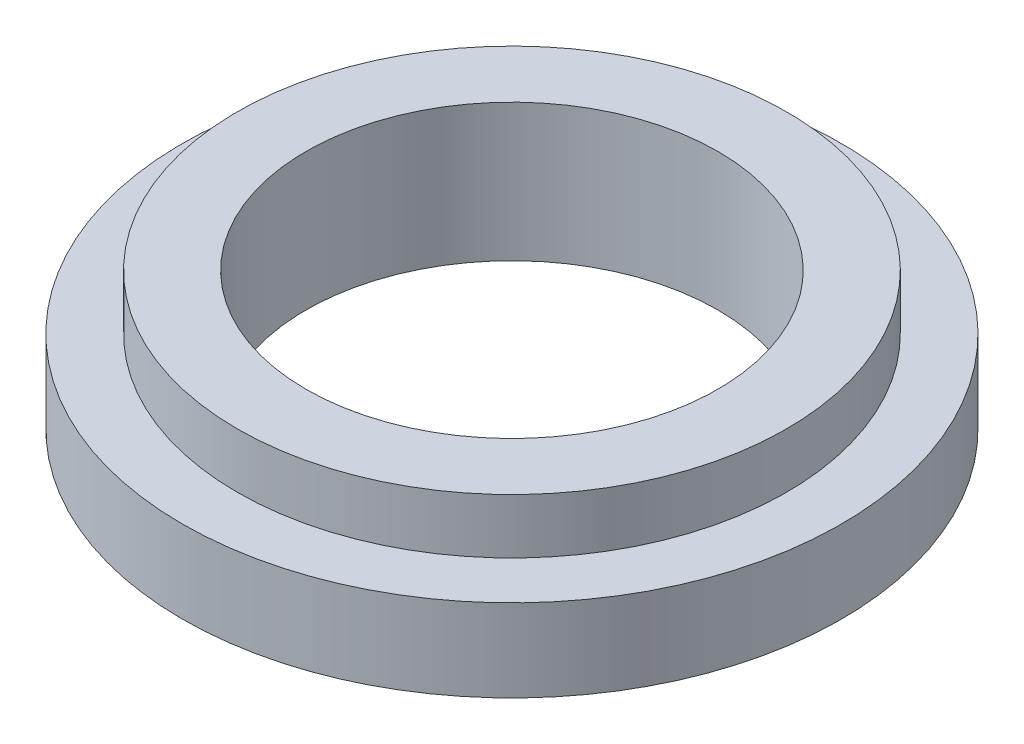
ISO-10303-21;
HEADER;
FILE_DESCRIPTION(('STEP AP214'),'2;1');
FILE_NAME('part.step','',(''),(''),'','','');
FILE_SCHEMA(('AUTOMOTIVE_DESIGN { 1 0 10303 214 1 1 1 1 }'));
ENDSEC;
DATA;
#1=APPLICATION_CONTEXT('core data for automotive mechanical design processes');
#2=APPLICATION_PROTOCOL_DEFINITION('international standard','automotive_design',2000,#1);
#3=PRODUCT_CONTEXT('',#1,'mechanical');
#4=PRODUCT('Part','Part','',(#3));
#5=PRODUCT_RELATED_PRODUCT_CATEGORY('part','',(#4));
#6=PRODUCT_DEFINITION_FORMATION('','',#4);
#7=PRODUCT_DEFINITION_CONTEXT('part definition',#1,'design');
#8=PRODUCT_DEFINITION('design','',#6,#7);
#9=PRODUCT_DEFINITION_SHAPE('','',#8);
#10=(LENGTH_UNIT() NAMED_UNIT(*) SI_UNIT(.MILLI.,.METRE.));
#11=(NAMED_UNIT(*) PLANE_ANGLE_UNIT() SI_UNIT($,.RADIAN.));
#12=(NAMED_UNIT(*) SI_UNIT($,.STERADIAN.) SOLID_ANGLE_UNIT());
#13=UNCERTAINTY_MEASURE_WITH_UNIT(LENGTH_MEASURE(1.E-05),#10,'distance_accuracy_value','');
#14=(GEOMETRIC_REPRESENTATION_CONTEXT(3) GLOBAL_UNCERTAINTY_ASSIGNED_CONTEXT((#13)) GLOBAL_UNIT_ASSIGNED_CONTEXT((#10,
#11,#12)) REPRESENTATION_CONTEXT('',''));
#15=CARTESIAN_POINT('',(0.,0.,0.));
#16=DIRECTION('',(0.,0.,1.));
#17=DIRECTION('',(1.,0.,0.));
#18=AXIS2_PLACEMENT_3D('',#15,#16,#17);
#19=CARTESIAN_POINT('',(0.,3.,0.));
#20=DIRECTION('',(0.,1.,0.));
#21=DIRECTION('',(0.,0.,1.));
#22=AXIS2_PLACEMENT_3D('',#19,#20,#21);
#23=PLANE('',#22);
#24=CARTESIAN_POINT('',(0.,3.,0.));
#25=DIRECTION('',(0.,1.,0.));
#26=DIRECTION('',(0.,0.,1.));
#27=AXIS2_PLACEMENT_3D('',#24,#25,#26);
#28=CIRCLE('',#27,12.);
#29=CARTESIAN_POINT('',(0.,3.,12.));
#30=VERTEX_POINT('',#29);
#31=EDGE_CURVE('E10',#30,#30,#28,.T.);
#32=ORIENTED_EDGE('',*,*,#31,.T.);
#33=EDGE_LOOP('',(#32));
#34=FACE_BOUND('',#33,.T.);
#35=CARTESIAN_POINT('',(0.,3.,0.));
#36=DIRECTION('',(0.,1.,0.));
#37=DIRECTION('',(0.,0.,1.));
#38=AXIS2_PLACEMENT_3D('',#35,#36,#37);
#39=CIRCLE('',#38,10.);
#40=CARTESIAN_POINT('',(0.,3.,10.));
#41=VERTEX_POINT('',#40);
#42=EDGE_CURVE('E83',#41,#41,#39,.T.);
#43=ORIENTED_EDGE('',*,*,#42,.F.);
#44=EDGE_LOOP('',(#43));
#45=FACE_BOUND('',#44,.T.);
#46=ADVANCED_FACE('F31',(#34,#45),#23,.T.);
#47=CARTESIAN_POINT('',(0.,0.,0.));
#48=DIRECTION('',(0.,1.,0.));
#49=DIRECTION('',(0.,0.,1.));
#50=AXIS2_PLACEMENT_3D('',#47,#48,#49);
#51=PLANE('',#50);
#52=CARTESIAN_POINT('',(0.,0.,10.));
#53=DIRECTION('',(0.,-1.,0.));
#54=DIRECTION('',(0.,0.,-1.));
#55=AXIS2_PLACEMENT_3D('',#52,#53,#54);
#56=CIRCLE('',#55,1.);
#57=CARTESIAN_POINT('',(0.,0.,9.));
#58=VERTEX_POINT('',#57);
#59=EDGE_CURVE('E72',#58,#58,#56,.T.);
#60=ORIENTED_EDGE('',*,*,#59,.F.);
#61=EDGE_LOOP('',(#60));
#62=FACE_BOUND('',#61,.T.);
#63=CARTESIAN_POINT('',(8.66025403784438,0.,5.00000000000001));
#64=DIRECTION('',(0.,-1.,0.));
#65=DIRECTION('',(0.,0.,-1.));
#66=AXIS2_PLACEMENT_3D('',#63,#64,#65);
#67=CIRCLE('',#66,1.);
#68=CARTESIAN_POINT('',(8.66025403784438,0.,4.));
#69=VERTEX_POINT('',#68);
#70=EDGE_CURVE('E73',#69,#69,#67,.T.);
#71=ORIENTED_EDGE('',*,*,#70,.F.);
#72=EDGE_LOOP('',(#71));
#73=FACE_BOUND('',#72,.T.);
#74=CARTESIAN_POINT('',(8.66025403784439,0.,-5.));
#75=DIRECTION('',(0.,-1.,0.));
#76=DIRECTION('',(0.,0.,-1.));
#77=AXIS2_PLACEMENT_3D('',#74,#75,#76);
#78=CIRCLE('',#77,1.);
#79=CARTESIAN_POINT('',(8.66025403784439,0.,-6.));
#80=VERTEX_POINT('',#79);
#81=EDGE_CURVE('E47',#80,#80,#78,.T.);
#82=ORIENTED_EDGE('',*,*,#81,.F.);
#83=EDGE_LOOP('',(#82));
#84=FACE_BOUND('',#83,.T.);
#85=CARTESIAN_POINT('',(0.,0.,-10.));
#86=DIRECTION('',(0.,-1.,0.));
#87=DIRECTION('',(0.,0.,-1.));
#88=AXIS2_PLACEMENT_3D('',#85,#86,#87);
#89=CIRCLE('',#88,1.);
#90=CARTESIAN_POINT('',(0.,0.,-11.));
#91=VERTEX_POINT('',#90);
#92=EDGE_CURVE('E54',#91,#91,#89,.T.);
#93=ORIENTED_EDGE('',*,*,#92,.F.);
#94=EDGE_LOOP('',(#93));
#95=FACE_BOUND('',#94,.T.);
#96=CARTESIAN_POINT('',(-8.66025403784439,0.,-5.));
#97=DIRECTION('',(0.,-1.,0.));
#98=DIRECTION('',(0.,0.,-1.));
#99=AXIS2_PLACEMENT_3D('',#96,#97,#98);
#100=CIRCLE('',#99,1.);
#101=CARTESIAN_POINT('',(-8.66025403784439,0.,-6.));
#102=VERTEX_POINT('',#101);
#103=EDGE_CURVE('E60',#102,#102,#100,.T.);
#104=ORIENTED_EDGE('',*,*,#103,.F.);
#105=EDGE_LOOP('',(#104));
#106=FACE_BOUND('',#105,.T.);
#107=CARTESIAN_POINT('',(-8.66025403784439,0.,5.00000000000001));
#108=DIRECTION('',(0.,-1.,0.));
#109=DIRECTION('',(0.,0.,-1.));
#110=AXIS2_PLACEMENT_3D('',#107,#108,#109);
#111=CIRCLE('',#110,1.);
#112=CARTESIAN_POINT('',(-8.66025403784439,0.,4.00000000000001));
#113=VERTEX_POINT('',#112);
#114=EDGE_CURVE('E66',#113,#113,#111,.T.);
#115=ORIENTED_EDGE('',*,*,#114,.F.);
#116=EDGE_LOOP('',(#115));
#117=FACE_BOUND('',#116,.T.);
#118=CARTESIAN_POINT('',(0.,0.,0.));
#119=DIRECTION('',(0.,1.,0.));
#120=DIRECTION('',(0.,0.,1.));
#121=AXIS2_PLACEMENT_3D('',#118,#119,#120);
#122=CIRCLE('',#121,12.);
#123=CARTESIAN_POINT('',(0.,0.,12.));
#124=VERTEX_POINT('',#123);
#125=EDGE_CURVE('E35',#124,#124,#122,.T.);
#126=ORIENTED_EDGE('',*,*,#125,.F.);
#127=EDGE_LOOP('',(#126));
#128=FACE_BOUND('',#127,.T.);
#129=CARTESIAN_POINT('',(0.,0.,0.));
#130=DIRECTION('',(0.,1.,0.));
#131=DIRECTION('',(0.,0.,1.));
#132=AXIS2_PLACEMENT_3D('',#129,#130,#131);
#133=CIRCLE('',#132,7.5);
#134=CARTESIAN_POINT('',(0.,0.,7.5));
#135=VERTEX_POINT('',#134);
#136=EDGE_CURVE('E42',#135,#135,#133,.T.);
#137=ORIENTED_EDGE('',*,*,#136,.T.);
#138=EDGE_LOOP('',(#137));
#139=FACE_BOUND('',#138,.T.);
#140=ADVANCED_FACE('F110',(#62,#73,#84,#95,#106,#117,#128,#139),#51,.F.);
#141=CARTESIAN_POINT('',(0.,3.,0.));
#142=DIRECTION('',(0.,-1.,0.));
#143=DIRECTION('',(0.,0.,-1.));
#144=AXIS2_PLACEMENT_3D('',#141,#142,#143);
#145=CYLINDRICAL_SURFACE('',#144,12.);
#146=ORIENTED_EDGE('',*,*,#31,.F.);
#147=EDGE_LOOP('',(#146));
#148=FACE_BOUND('',#147,.T.);
#149=ORIENTED_EDGE('',*,*,#125,.T.);
#150=EDGE_LOOP('',(#149));
#151=FACE_BOUND('',#150,.T.);
#152=ADVANCED_FACE('F33',(#148,#151),#145,.T.);
#153=CARTESIAN_POINT('',(0.,3.,0.));
#154=DIRECTION('',(0.,-1.,0.));
#155=DIRECTION('',(0.,0.,-1.));
#156=AXIS2_PLACEMENT_3D('',#153,#154,#155);
#157=CYLINDRICAL_SURFACE('',#156,7.5);
#158=ORIENTED_EDGE('',*,*,#136,.F.);
#159=EDGE_LOOP('',(#158));
#160=FACE_BOUND('',#159,.T.);
#161=CARTESIAN_POINT('',(0.,5.,0.));
#162=DIRECTION('',(0.,1.,0.));
#163=DIRECTION('',(0.,0.,1.));
#164=AXIS2_PLACEMENT_3D('',#161,#162,#163);
#165=CIRCLE('',#164,7.5);
#166=CARTESIAN_POINT('',(0.,5.,7.5));
#167=VERTEX_POINT('',#166);
#168=EDGE_CURVE('E86',#167,#167,#165,.T.);
#169=ORIENTED_EDGE('',*,*,#168,.T.);
#170=EDGE_LOOP('',(#169));
#171=FACE_BOUND('',#170,.T.);
#172=ADVANCED_FACE('F92',(#160,#171),#157,.F.);
#173=CARTESIAN_POINT('',(-8.66025403784439,2.2,5.00000000000001));
#174=DIRECTION('',(0.,-1.,0.));
#175=DIRECTION('',(0.,0.,-1.));
#176=AXIS2_PLACEMENT_3D('',#173,#174,#175);
#177=CYLINDRICAL_SURFACE('',#176,1.);
#178=CARTESIAN_POINT('',(-8.66025403784439,2.2,5.00000000000001));
#179=DIRECTION('',(0.,-1.,0.));
#180=DIRECTION('',(0.,0.,-1.));
#181=AXIS2_PLACEMENT_3D('',#178,#179,#180);
#182=CIRCLE('',#181,1.);
#183=CARTESIAN_POINT('',(-8.66025403784439,2.2,4.00000000000001));
#184=VERTEX_POINT('',#183);
#185=EDGE_CURVE('E69',#184,#184,#182,.T.);
#186=ORIENTED_EDGE('',*,*,#185,.F.);
#187=EDGE_LOOP('',(#186));
#188=FACE_BOUND('',#187,.T.);
#189=ORIENTED_EDGE('',*,*,#114,.T.);
#190=EDGE_LOOP('',(#189));
#191=FACE_BOUND('',#190,.T.);
#192=ADVANCED_FACE('F120',(#188,#191),#177,.F.);
#193=CARTESIAN_POINT('',(-8.66025403784439,2.2,5.00000000000001));
#194=DIRECTION('',(0.,-1.,0.));
#195=DIRECTION('',(0.,0.,-1.));
#196=AXIS2_PLACEMENT_3D('',#193,#194,#195);
#197=PLANE('',#196);
#198=ORIENTED_EDGE('',*,*,#185,.T.);
#199=EDGE_LOOP('',(#198));
#200=FACE_BOUND('',#199,.T.);
#201=ADVANCED_FACE('F143',(#200),#197,.T.);
#202=CARTESIAN_POINT('',(-8.66025403784439,2.2,-5.));
#203=DIRECTION('',(0.,-1.,0.));
#204=DIRECTION('',(0.,0.,-1.));
#205=AXIS2_PLACEMENT_3D('',#202,#203,#204);
#206=CYLINDRICAL_SURFACE('',#205,1.);
#207=CARTESIAN_POINT('',(-8.66025403784439,2.2,-5.));
#208=DIRECTION('',(0.,-1.,0.));
#209=DIRECTION('',(0.,0.,-1.));
#210=AXIS2_PLACEMENT_3D('',#207,#208,#209);
#211=CIRCLE('',#210,1.);
#212=CARTESIAN_POINT('',(-8.66025403784439,2.2,-6.));
#213=VERTEX_POINT('',#212);
#214=EDGE_CURVE('E63',#213,#213,#211,.T.);
#215=ORIENTED_EDGE('',*,*,#214,.F.);
#216=EDGE_LOOP('',(#215));
#217=FACE_BOUND('',#216,.T.);
#218=ORIENTED_EDGE('',*,*,#103,.T.);
#219=EDGE_LOOP('',(#218));
#220=FACE_BOUND('',#219,.T.);
#221=ADVANCED_FACE('F140',(#217,#220),#206,.F.);
#222=CARTESIAN_POINT('',(-8.66025403784439,2.2,-5.));
#223=DIRECTION('',(0.,-1.,0.));
#224=DIRECTION('',(0.,0.,-1.));
#225=AXIS2_PLACEMENT_3D('',#222,#223,#224);
#226=PLANE('',#225);
#227=ORIENTED_EDGE('',*,*,#214,.T.);
#228=EDGE_LOOP('',(#227));
#229=FACE_BOUND('',#228,.T.);
#230=ADVANCED_FACE('F135',(#229),#226,.T.);
#231=CARTESIAN_POINT('',(0.,2.2,-10.));
#232=DIRECTION('',(0.,-1.,0.));
#233=DIRECTION('',(0.,0.,-1.));
#234=AXIS2_PLACEMENT_3D('',#231,#232,#233);
#235=CYLINDRICAL_SURFACE('',#234,1.);
#236=CARTESIAN_POINT('',(0.,2.2,-10.));
#237=DIRECTION('',(0.,-1.,0.));
#238=DIRECTION('',(0.,0.,-1.));
#239=AXIS2_PLACEMENT_3D('',#236,#237,#238);
#240=CIRCLE('',#239,1.);
#241=CARTESIAN_POINT('',(0.,2.2,-11.));
#242=VERTEX_POINT('',#241);
#243=EDGE_CURVE('E57',#242,#242,#240,.T.);
#244=ORIENTED_EDGE('',*,*,#243,.F.);
#245=EDGE_LOOP('',(#244));
#246=FACE_BOUND('',#245,.T.);
#247=ORIENTED_EDGE('',*,*,#92,.T.);
#248=EDGE_LOOP('',(#247));
#249=FACE_BOUND('',#248,.T.);
#250=ADVANCED_FACE('F132',(#246,#249),#235,.F.);
#251=CARTESIAN_POINT('',(0.,2.2,-10.));
#252=DIRECTION('',(0.,-1.,0.));
#253=DIRECTION('',(0.,0.,-1.));
#254=AXIS2_PLACEMENT_3D('',#251,#252,#253);
#255=PLANE('',#254);
#256=ORIENTED_EDGE('',*,*,#243,.T.);
#257=EDGE_LOOP('',(#256));
#258=FACE_BOUND('',#257,.T.);
#259=ADVANCED_FACE('F126',(#258),#255,.T.);
#260=CARTESIAN_POINT('',(8.66025403784439,2.2,-5.));
#261=DIRECTION('',(0.,-1.,0.));
#262=DIRECTION('',(0.,0.,-1.));
#263=AXIS2_PLACEMENT_3D('',#260,#261,#262);
#264=CYLINDRICAL_SURFACE('',#263,1.);
#265=CARTESIAN_POINT('',(8.66025403784439,2.2,-5.));
#266=DIRECTION('',(0.,-1.,0.));
#267=DIRECTION('',(0.,0.,-1.));
#268=AXIS2_PLACEMENT_3D('',#265,#266,#267);
#269=CIRCLE('',#268,1.);
#270=CARTESIAN_POINT('',(8.66025403784439,2.2,-6.));
#271=VERTEX_POINT('',#270);
#272=EDGE_CURVE('E50',#271,#271,#269,.T.);
#273=ORIENTED_EDGE('',*,*,#272,.F.);
#274=EDGE_LOOP('',(#273));
#275=FACE_BOUND('',#274,.T.);
#276=ORIENTED_EDGE('',*,*,#81,.T.);
#277=EDGE_LOOP('',(#276));
#278=FACE_BOUND('',#277,.T.);
#279=ADVANCED_FACE('F122',(#275,#278),#264,.F.);
#280=CARTESIAN_POINT('',(8.66025403784439,2.2,-5.));
#281=DIRECTION('',(0.,-1.,0.));
#282=DIRECTION('',(0.,0.,-1.));
#283=AXIS2_PLACEMENT_3D('',#280,#281,#282);
#284=PLANE('',#283);
#285=ORIENTED_EDGE('',*,*,#272,.T.);
#286=EDGE_LOOP('',(#285));
#287=FACE_BOUND('',#286,.T.);
#288=ADVANCED_FACE('F125',(#287),#284,.T.);
#289=CARTESIAN_POINT('',(8.66025403784438,2.2,5.00000000000001));
#290=DIRECTION('',(0.,-1.,0.));
#291=DIRECTION('',(0.,0.,-1.));
#292=AXIS2_PLACEMENT_3D('',#289,#290,#291);
#293=CYLINDRICAL_SURFACE('',#292,1.);
#294=CARTESIAN_POINT('',(8.66025403784438,2.2,5.00000000000001));
#295=DIRECTION('',(0.,-1.,0.));
#296=DIRECTION('',(0.,0.,-1.));
#297=AXIS2_PLACEMENT_3D('',#294,#295,#296);
#298=CIRCLE('',#297,1.);
#299=CARTESIAN_POINT('',(8.66025403784438,2.2,4.));
#300=VERTEX_POINT('',#299);
#301=EDGE_CURVE('E51',#300,#300,#298,.T.);
#302=ORIENTED_EDGE('',*,*,#301,.F.);
#303=EDGE_LOOP('',(#302));
#304=FACE_BOUND('',#303,.T.);
#305=ORIENTED_EDGE('',*,*,#70,.T.);
#306=EDGE_LOOP('',(#305));
#307=FACE_BOUND('',#306,.T.);
#308=ADVANCED_FACE('F130',(#304,#307),#293,.F.);
#309=CARTESIAN_POINT('',(8.66025403784438,2.2,5.00000000000001));
#310=DIRECTION('',(0.,-1.,0.));
#311=DIRECTION('',(0.,0.,-1.));
#312=AXIS2_PLACEMENT_3D('',#309,#310,#311);
#313=PLANE('',#312);
#314=ORIENTED_EDGE('',*,*,#301,.T.);
#315=EDGE_LOOP('',(#314));
#316=FACE_BOUND('',#315,.T.);
#317=ADVANCED_FACE('F156',(#316),#313,.T.);
#318=CARTESIAN_POINT('',(0.,2.2,10.));
#319=DIRECTION('',(0.,-1.,0.));
#320=DIRECTION('',(0.,0.,-1.));
#321=AXIS2_PLACEMENT_3D('',#318,#319,#320);
#322=CYLINDRICAL_SURFACE('',#321,1.);
#323=CARTESIAN_POINT('',(0.,2.2,10.));
#324=DIRECTION('',(0.,-1.,0.));
#325=DIRECTION('',(0.,0.,-1.));
#326=AXIS2_PLACEMENT_3D('',#323,#324,#325);
#327=CIRCLE('',#326,1.);
#328=CARTESIAN_POINT('',(0.,2.2,9.));
#329=VERTEX_POINT('',#328);
#330=EDGE_CURVE('E46',#329,#329,#327,.T.);
#331=ORIENTED_EDGE('',*,*,#330,.F.);
#332=EDGE_LOOP('',(#331));
#333=FACE_BOUND('',#332,.T.);
#334=ORIENTED_EDGE('',*,*,#59,.T.);
#335=EDGE_LOOP('',(#334));
#336=FACE_BOUND('',#335,.T.);
#337=ADVANCED_FACE('F106',(#333,#336),#322,.F.);
#338=CARTESIAN_POINT('',(0.,2.2,10.));
#339=DIRECTION('',(0.,-1.,0.));
#340=DIRECTION('',(0.,0.,-1.));
#341=AXIS2_PLACEMENT_3D('',#338,#339,#340);
#342=PLANE('',#341);
#343=ORIENTED_EDGE('',*,*,#330,.T.);
#344=EDGE_LOOP('',(#343));
#345=FACE_BOUND('',#344,.T.);
#346=ADVANCED_FACE('F97',(#345),#342,.T.);
#347=CARTESIAN_POINT('',(0.,5.,0.));
#348=DIRECTION('',(0.,1.,0.));
#349=DIRECTION('',(0.,0.,1.));
#350=AXIS2_PLACEMENT_3D('',#347,#348,#349);
#351=PLANE('',#350);
#352=CARTESIAN_POINT('',(0.,5.,0.));
#353=DIRECTION('',(0.,1.,0.));
#354=DIRECTION('',(0.,0.,1.));
#355=AXIS2_PLACEMENT_3D('',#352,#353,#354);
#356=CIRCLE('',#355,10.);
#357=CARTESIAN_POINT('',(0.,5.,10.));
#358=VERTEX_POINT('',#357);
#359=EDGE_CURVE('E76',#358,#358,#356,.T.);
#360=ORIENTED_EDGE('',*,*,#359,.T.);
#361=EDGE_LOOP('',(#360));
#362=FACE_BOUND('',#361,.T.);
#363=ORIENTED_EDGE('',*,*,#168,.F.);
#364=EDGE_LOOP('',(#363));
#365=FACE_BOUND('',#364,.T.);
#366=ADVANCED_FACE('F94',(#362,#365),#351,.T.);
#367=CARTESIAN_POINT('',(0.,5.,0.));
#368=DIRECTION('',(0.,-1.,0.));
#369=DIRECTION('',(0.,0.,-1.));
#370=AXIS2_PLACEMENT_3D('',#367,#368,#369);
#371=CYLINDRICAL_SURFACE('',#370,10.);
#372=ORIENTED_EDGE('',*,*,#359,.F.);
#373=EDGE_LOOP('',(#372));
#374=FACE_BOUND('',#373,.T.);
#375=ORIENTED_EDGE('',*,*,#42,.T.);
#376=EDGE_LOOP('',(#375));
#377=FACE_BOUND('',#376,.T.);
#378=ADVANCED_FACE('F96',(#374,#377),#371,.T.);
#379=CLOSED_SHELL('',(#46,#140,#152,#172,#192,#201,#221,#230,#250,#259,#279,#288,#308,#317,#337,
#346,#366,#378));
#380=MANIFOLD_SOLID_BREP('B2',#379);
#381=ADVANCED_BREP_SHAPE_REPRESENTATION('',(#18,#380),#14);
#382=SHAPE_DEFINITION_REPRESENTATION(#9,#381);
ENDSEC;
END-ISO-10303-21;
